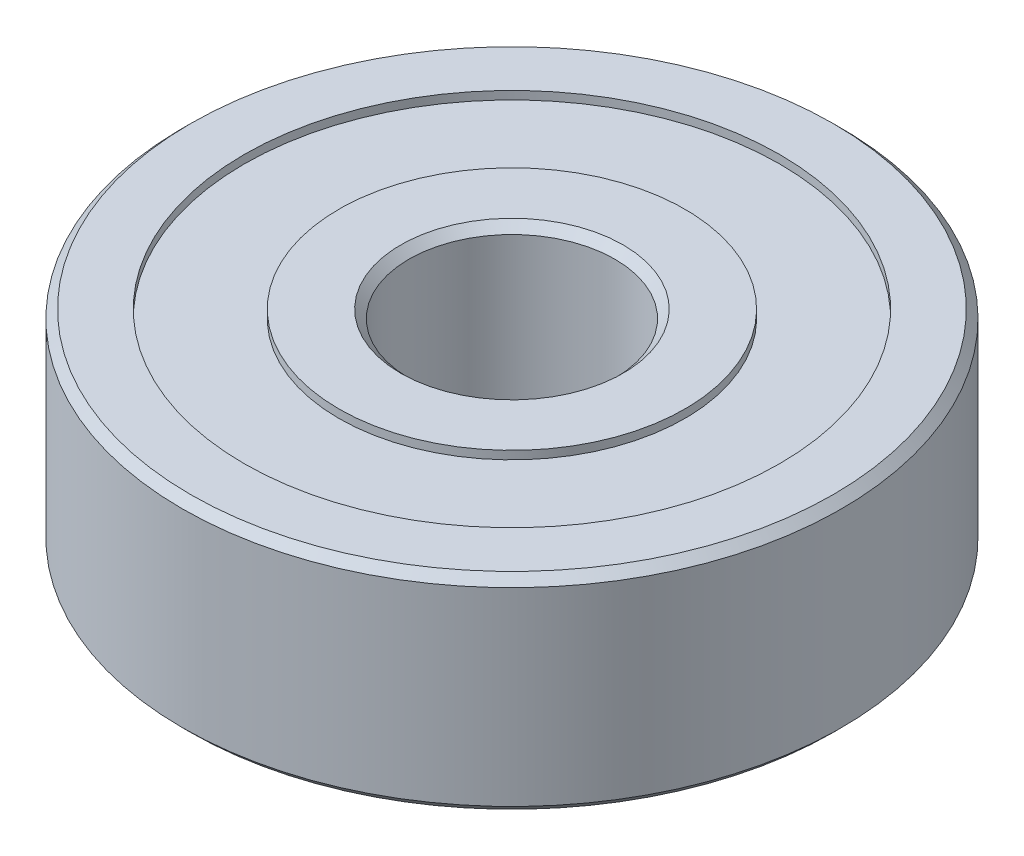
ISO-10303-21;
HEADER;
FILE_DESCRIPTION(('STEP AP214'),'2;1');
FILE_NAME('part.step','',(''),(''),'','','');
FILE_SCHEMA(('AUTOMOTIVE_DESIGN { 1 0 10303 214 1 1 1 1 }'));
ENDSEC;
DATA;
#1=APPLICATION_CONTEXT('core data for automotive mechanical design processes');
#2=APPLICATION_PROTOCOL_DEFINITION('international standard','automotive_design',2000,#1);
#3=PRODUCT_CONTEXT('',#1,'mechanical');
#4=PRODUCT('Part','Part','',(#3));
#5=PRODUCT_RELATED_PRODUCT_CATEGORY('part','',(#4));
#6=PRODUCT_DEFINITION_FORMATION('','',#4);
#7=PRODUCT_DEFINITION_CONTEXT('part definition',#1,'design');
#8=PRODUCT_DEFINITION('design','',#6,#7);
#9=PRODUCT_DEFINITION_SHAPE('','',#8);
#10=(LENGTH_UNIT() NAMED_UNIT(*) SI_UNIT(.MILLI.,.METRE.));
#11=(NAMED_UNIT(*) PLANE_ANGLE_UNIT() SI_UNIT($,.RADIAN.));
#12=(NAMED_UNIT(*) SI_UNIT($,.STERADIAN.) SOLID_ANGLE_UNIT());
#13=UNCERTAINTY_MEASURE_WITH_UNIT(LENGTH_MEASURE(1.E-05),#10,'distance_accuracy_value','');
#14=(GEOMETRIC_REPRESENTATION_CONTEXT(3) GLOBAL_UNCERTAINTY_ASSIGNED_CONTEXT((#13)) GLOBAL_UNIT_ASSIGNED_CONTEXT((#10,
#11,#12)) REPRESENTATION_CONTEXT('',''));
#15=CARTESIAN_POINT('',(0.,0.,0.));
#16=DIRECTION('',(0.,0.,1.));
#17=DIRECTION('',(1.,0.,0.));
#18=AXIS2_PLACEMENT_3D('',#15,#16,#17);
#19=CARTESIAN_POINT('',(0.,0.,0.));
#20=DIRECTION('',(0.,1.,0.));
#21=DIRECTION('',(0.,0.,1.));
#22=AXIS2_PLACEMENT_3D('',#19,#20,#21);
#23=PLANE('',#22);
#24=CARTESIAN_POINT('',(0.,0.,0.));
#25=DIRECTION('',(0.,1.,0.));
#26=DIRECTION('',(0.,0.,1.));
#27=AXIS2_PLACEMENT_3D('',#24,#25,#26);
#28=CIRCLE('',#27,2.69999999999999);
#29=CARTESIAN_POINT('',(0.,0.,2.69999999999999));
#30=VERTEX_POINT('',#29);
#31=EDGE_CURVE('E10',#30,#30,#28,.T.);
#32=ORIENTED_EDGE('',*,*,#31,.T.);
#33=EDGE_LOOP('',(#32));
#34=FACE_BOUND('',#33,.T.);
#35=CARTESIAN_POINT('',(0.,0.,0.));
#36=DIRECTION('',(0.,-1.,0.));
#37=DIRECTION('',(0.,0.,-1.));
#38=AXIS2_PLACEMENT_3D('',#35,#36,#37);
#39=CIRCLE('',#38,4.2);
#40=CARTESIAN_POINT('',(0.,0.,-4.2));
#41=VERTEX_POINT('',#40);
#42=EDGE_CURVE('E86',#41,#41,#39,.T.);
#43=ORIENTED_EDGE('',*,*,#42,.T.);
#44=EDGE_LOOP('',(#43));
#45=FACE_BOUND('',#44,.T.);
#46=ADVANCED_FACE('F34',(#34,#45),#23,.F.);
#47=CARTESIAN_POINT('',(0.,5.,0.));
#48=DIRECTION('',(0.,1.,0.));
#49=DIRECTION('',(0.,0.,1.));
#50=AXIS2_PLACEMENT_3D('',#47,#48,#49);
#51=PLANE('',#50);
#52=CARTESIAN_POINT('',(0.,5.,0.));
#53=DIRECTION('',(0.,1.,0.));
#54=DIRECTION('',(0.,0.,1.));
#55=AXIS2_PLACEMENT_3D('',#52,#53,#54);
#56=CIRCLE('',#55,2.7);
#57=CARTESIAN_POINT('',(0.,5.,2.7));
#58=VERTEX_POINT('',#57);
#59=EDGE_CURVE('E42',#58,#58,#56,.F.);
#60=ORIENTED_EDGE('',*,*,#59,.T.);
#61=EDGE_LOOP('',(#60));
#62=FACE_BOUND('',#61,.T.);
#63=CARTESIAN_POINT('',(0.,5.,0.));
#64=DIRECTION('',(0.,1.,0.));
#65=DIRECTION('',(0.,0.,1.));
#66=AXIS2_PLACEMENT_3D('',#63,#64,#65);
#67=CIRCLE('',#66,4.2);
#68=CARTESIAN_POINT('',(0.,5.,4.2));
#69=VERTEX_POINT('',#68);
#70=EDGE_CURVE('E74',#69,#69,#67,.T.);
#71=ORIENTED_EDGE('',*,*,#70,.T.);
#72=EDGE_LOOP('',(#71));
#73=FACE_BOUND('',#72,.T.);
#74=ADVANCED_FACE('F121',(#62,#73),#51,.T.);
#75=CARTESIAN_POINT('',(0.,5.,0.));
#76=DIRECTION('',(0.,1.,0.));
#77=DIRECTION('',(0.,0.,1.));
#78=AXIS2_PLACEMENT_3D('',#75,#76,#77);
#79=CIRCLE('',#78,7.80000000000001);
#80=CARTESIAN_POINT('',(0.,5.,7.80000000000001));
#81=VERTEX_POINT('',#80);
#82=EDGE_CURVE('E64',#81,#81,#79,.T.);
#83=ORIENTED_EDGE('',*,*,#82,.T.);
#84=EDGE_LOOP('',(#83));
#85=FACE_BOUND('',#84,.T.);
#86=CARTESIAN_POINT('',(0.,5.,0.));
#87=DIRECTION('',(0.,1.,0.));
#88=DIRECTION('',(0.,0.,1.));
#89=AXIS2_PLACEMENT_3D('',#86,#87,#88);
#90=CIRCLE('',#89,6.5);
#91=CARTESIAN_POINT('',(0.,5.,6.5));
#92=VERTEX_POINT('',#91);
#93=EDGE_CURVE('E68',#92,#92,#90,.T.);
#94=ORIENTED_EDGE('',*,*,#93,.F.);
#95=EDGE_LOOP('',(#94));
#96=FACE_BOUND('',#95,.T.);
#97=ADVANCED_FACE('F111',(#85,#96),#51,.T.);
#98=CARTESIAN_POINT('',(0.,0.,0.));
#99=DIRECTION('',(0.,1.,0.));
#100=DIRECTION('',(0.,0.,1.));
#101=AXIS2_PLACEMENT_3D('',#98,#99,#100);
#102=CIRCLE('',#101,7.8);
#103=CARTESIAN_POINT('',(0.,0.,7.8));
#104=VERTEX_POINT('',#103);
#105=EDGE_CURVE('E55',#104,#104,#102,.F.);
#106=ORIENTED_EDGE('',*,*,#105,.T.);
#107=EDGE_LOOP('',(#106));
#108=FACE_BOUND('',#107,.T.);
#109=CARTESIAN_POINT('',(0.,0.,0.));
#110=DIRECTION('',(0.,-1.,0.));
#111=DIRECTION('',(0.,0.,-1.));
#112=AXIS2_PLACEMENT_3D('',#109,#110,#111);
#113=CIRCLE('',#112,6.5);
#114=CARTESIAN_POINT('',(0.,0.,-6.5));
#115=VERTEX_POINT('',#114);
#116=EDGE_CURVE('E80',#115,#115,#113,.T.);
#117=ORIENTED_EDGE('',*,*,#116,.F.);
#118=EDGE_LOOP('',(#117));
#119=FACE_BOUND('',#118,.T.);
#120=ADVANCED_FACE('F108',(#108,#119),#23,.F.);
#121=CARTESIAN_POINT('',(0.,5.,0.));
#122=DIRECTION('',(0.,-1.,0.));
#123=DIRECTION('',(0.,0.,-1.));
#124=AXIS2_PLACEMENT_3D('',#121,#122,#123);
#125=CYLINDRICAL_SURFACE('',#124,8.);
#126=CARTESIAN_POINT('',(0.,4.80000000000001,0.));
#127=DIRECTION('',(0.,1.,0.));
#128=DIRECTION('',(0.,0.,1.));
#129=AXIS2_PLACEMENT_3D('',#126,#127,#128);
#130=CIRCLE('',#129,8.);
#131=CARTESIAN_POINT('',(0.,4.80000000000001,8.));
#132=VERTEX_POINT('',#131);
#133=EDGE_CURVE('E58',#132,#132,#130,.F.);
#134=ORIENTED_EDGE('',*,*,#133,.T.);
#135=EDGE_LOOP('',(#134));
#136=FACE_BOUND('',#135,.T.);
#137=CARTESIAN_POINT('',(0.,0.199999999999999,0.));
#138=DIRECTION('',(0.,1.,0.));
#139=DIRECTION('',(0.,0.,1.));
#140=AXIS2_PLACEMENT_3D('',#137,#138,#139);
#141=CIRCLE('',#140,8.);
#142=CARTESIAN_POINT('',(0.,0.199999999999999,8.));
#143=VERTEX_POINT('',#142);
#144=EDGE_CURVE('E61',#143,#143,#141,.T.);
#145=ORIENTED_EDGE('',*,*,#144,.T.);
#146=EDGE_LOOP('',(#145));
#147=FACE_BOUND('',#146,.T.);
#148=ADVANCED_FACE('F110',(#136,#147),#125,.T.);
#149=CARTESIAN_POINT('',(0.,5.,0.));
#150=DIRECTION('',(0.,-1.,0.));
#151=DIRECTION('',(0.,0.,-1.));
#152=AXIS2_PLACEMENT_3D('',#149,#150,#151);
#153=CYLINDRICAL_SURFACE('',#152,2.5);
#154=CARTESIAN_POINT('',(0.,4.80000000000001,0.));
#155=DIRECTION('',(0.,1.,0.));
#156=DIRECTION('',(0.,0.,1.));
#157=AXIS2_PLACEMENT_3D('',#154,#155,#156);
#158=CIRCLE('',#157,2.5);
#159=CARTESIAN_POINT('',(0.,4.80000000000001,2.5));
#160=VERTEX_POINT('',#159);
#161=EDGE_CURVE('E46',#160,#160,#158,.T.);
#162=ORIENTED_EDGE('',*,*,#161,.T.);
#163=EDGE_LOOP('',(#162));
#164=FACE_BOUND('',#163,.T.);
#165=CARTESIAN_POINT('',(0.,0.199999999999996,0.));
#166=DIRECTION('',(0.,1.,0.));
#167=DIRECTION('',(0.,0.,1.));
#168=AXIS2_PLACEMENT_3D('',#165,#166,#167);
#169=CIRCLE('',#168,2.5);
#170=CARTESIAN_POINT('',(0.,0.199999999999996,2.5));
#171=VERTEX_POINT('',#170);
#172=EDGE_CURVE('E50',#171,#171,#169,.F.);
#173=ORIENTED_EDGE('',*,*,#172,.T.);
#174=EDGE_LOOP('',(#173));
#175=FACE_BOUND('',#174,.T.);
#176=ADVANCED_FACE('F118',(#164,#175),#153,.F.);
#177=CARTESIAN_POINT('',(0.,4.8,0.));
#178=DIRECTION('',(0.,1.,0.));
#179=DIRECTION('',(0.,0.,1.));
#180=AXIS2_PLACEMENT_3D('',#177,#178,#179);
#181=CYLINDRICAL_SURFACE('',#180,6.5);
#182=CARTESIAN_POINT('',(0.,4.8,0.));
#183=DIRECTION('',(0.,1.,0.));
#184=DIRECTION('',(0.,0.,1.));
#185=AXIS2_PLACEMENT_3D('',#182,#183,#184);
#186=CIRCLE('',#185,6.5);
#187=CARTESIAN_POINT('',(0.,4.8,6.5));
#188=VERTEX_POINT('',#187);
#189=EDGE_CURVE('E67',#188,#188,#186,.T.);
#190=ORIENTED_EDGE('',*,*,#189,.F.);
#191=EDGE_LOOP('',(#190));
#192=FACE_BOUND('',#191,.T.);
#193=ORIENTED_EDGE('',*,*,#93,.T.);
#194=EDGE_LOOP('',(#193));
#195=FACE_BOUND('',#194,.T.);
#196=ADVANCED_FACE('F146',(#192,#195),#181,.F.);
#197=CARTESIAN_POINT('',(0.,4.8,0.));
#198=DIRECTION('',(0.,1.,0.));
#199=DIRECTION('',(0.,0.,1.));
#200=AXIS2_PLACEMENT_3D('',#197,#198,#199);
#201=PLANE('',#200);
#202=CARTESIAN_POINT('',(0.,4.8,0.));
#203=DIRECTION('',(0.,1.,0.));
#204=DIRECTION('',(0.,0.,1.));
#205=AXIS2_PLACEMENT_3D('',#202,#203,#204);
#206=CIRCLE('',#205,4.2);
#207=CARTESIAN_POINT('',(0.,4.8,4.2));
#208=VERTEX_POINT('',#207);
#209=EDGE_CURVE('E71',#208,#208,#206,.T.);
#210=ORIENTED_EDGE('',*,*,#209,.F.);
#211=EDGE_LOOP('',(#210));
#212=FACE_BOUND('',#211,.T.);
#213=ORIENTED_EDGE('',*,*,#189,.T.);
#214=EDGE_LOOP('',(#213));
#215=FACE_BOUND('',#214,.T.);
#216=ADVANCED_FACE('F142',(#212,#215),#201,.T.);
#217=CARTESIAN_POINT('',(0.,4.8,0.));
#218=DIRECTION('',(0.,1.,0.));
#219=DIRECTION('',(0.,0.,1.));
#220=AXIS2_PLACEMENT_3D('',#217,#218,#219);
#221=CYLINDRICAL_SURFACE('',#220,4.2);
#222=ORIENTED_EDGE('',*,*,#209,.T.);
#223=EDGE_LOOP('',(#222));
#224=FACE_BOUND('',#223,.T.);
#225=ORIENTED_EDGE('',*,*,#70,.F.);
#226=EDGE_LOOP('',(#225));
#227=FACE_BOUND('',#226,.T.);
#228=ADVANCED_FACE('F104',(#224,#227),#221,.T.);
#229=CARTESIAN_POINT('',(0.,0.2,0.));
#230=DIRECTION('',(0.,-1.,0.));
#231=DIRECTION('',(0.,0.,-1.));
#232=AXIS2_PLACEMENT_3D('',#229,#230,#231);
#233=CYLINDRICAL_SURFACE('',#232,6.5);
#234=CARTESIAN_POINT('',(0.,0.2,0.));
#235=DIRECTION('',(0.,-1.,0.));
#236=DIRECTION('',(0.,0.,-1.));
#237=AXIS2_PLACEMENT_3D('',#234,#235,#236);
#238=CIRCLE('',#237,6.5);
#239=CARTESIAN_POINT('',(0.,0.2,-6.5));
#240=VERTEX_POINT('',#239);
#241=EDGE_CURVE('E77',#240,#240,#238,.T.);
#242=ORIENTED_EDGE('',*,*,#241,.F.);
#243=EDGE_LOOP('',(#242));
#244=FACE_BOUND('',#243,.T.);
#245=ORIENTED_EDGE('',*,*,#116,.T.);
#246=EDGE_LOOP('',(#245));
#247=FACE_BOUND('',#246,.T.);
#248=ADVANCED_FACE('F98',(#244,#247),#233,.F.);
#249=CARTESIAN_POINT('',(0.,0.2,0.));
#250=DIRECTION('',(0.,-1.,0.));
#251=DIRECTION('',(0.,0.,-1.));
#252=AXIS2_PLACEMENT_3D('',#249,#250,#251);
#253=PLANE('',#252);
#254=CARTESIAN_POINT('',(0.,0.2,0.));
#255=DIRECTION('',(0.,-1.,0.));
#256=DIRECTION('',(0.,0.,-1.));
#257=AXIS2_PLACEMENT_3D('',#254,#255,#256);
#258=CIRCLE('',#257,4.2);
#259=CARTESIAN_POINT('',(0.,0.2,-4.2));
#260=VERTEX_POINT('',#259);
#261=EDGE_CURVE('E83',#260,#260,#258,.T.);
#262=ORIENTED_EDGE('',*,*,#261,.F.);
#263=EDGE_LOOP('',(#262));
#264=FACE_BOUND('',#263,.T.);
#265=ORIENTED_EDGE('',*,*,#241,.T.);
#266=EDGE_LOOP('',(#265));
#267=FACE_BOUND('',#266,.T.);
#268=ADVANCED_FACE('F95',(#264,#267),#253,.T.);
#269=CARTESIAN_POINT('',(0.,0.2,0.));
#270=DIRECTION('',(0.,-1.,0.));
#271=DIRECTION('',(0.,0.,-1.));
#272=AXIS2_PLACEMENT_3D('',#269,#270,#271);
#273=CYLINDRICAL_SURFACE('',#272,4.2);
#274=ORIENTED_EDGE('',*,*,#261,.T.);
#275=EDGE_LOOP('',(#274));
#276=FACE_BOUND('',#275,.T.);
#277=ORIENTED_EDGE('',*,*,#42,.F.);
#278=EDGE_LOOP('',(#277));
#279=FACE_BOUND('',#278,.T.);
#280=ADVANCED_FACE('F92',(#276,#279),#273,.T.);
#281=CARTESIAN_POINT('',(0.,5.,0.));
#282=DIRECTION('',(0.,-1.,0.));
#283=DIRECTION('',(0.,0.,-1.));
#284=AXIS2_PLACEMENT_3D('',#281,#282,#283);
#285=CONICAL_SURFACE('',#284,7.80000000000001,0.785398163397448);
#286=ORIENTED_EDGE('',*,*,#133,.F.);
#287=EDGE_LOOP('',(#286));
#288=FACE_BOUND('',#287,.T.);
#289=ORIENTED_EDGE('',*,*,#82,.F.);
#290=EDGE_LOOP('',(#289));
#291=FACE_BOUND('',#290,.T.);
#292=ADVANCED_FACE('F131',(#288,#291),#285,.T.);
#293=CARTESIAN_POINT('',(0.,0.199999999999999,0.));
#294=DIRECTION('',(0.,1.,0.));
#295=DIRECTION('',(0.,0.,1.));
#296=AXIS2_PLACEMENT_3D('',#293,#294,#295);
#297=CONICAL_SURFACE('',#296,8.,0.785398163397444);
#298=ORIENTED_EDGE('',*,*,#105,.F.);
#299=EDGE_LOOP('',(#298));
#300=FACE_BOUND('',#299,.T.);
#301=ORIENTED_EDGE('',*,*,#144,.F.);
#302=EDGE_LOOP('',(#301));
#303=FACE_BOUND('',#302,.T.);
#304=ADVANCED_FACE('F136',(#300,#303),#297,.T.);
#305=CARTESIAN_POINT('',(0.,4.80000000000001,0.));
#306=DIRECTION('',(0.,1.,0.));
#307=DIRECTION('',(0.,0.,1.));
#308=AXIS2_PLACEMENT_3D('',#305,#306,#307);
#309=CONICAL_SURFACE('',#308,2.5,0.785398163397458);
#310=ORIENTED_EDGE('',*,*,#59,.F.);
#311=EDGE_LOOP('',(#310));
#312=FACE_BOUND('',#311,.T.);
#313=ORIENTED_EDGE('',*,*,#161,.F.);
#314=EDGE_LOOP('',(#313));
#315=FACE_BOUND('',#314,.T.);
#316=ADVANCED_FACE('F161',(#312,#315),#309,.F.);
#317=CARTESIAN_POINT('',(0.,0.,0.));
#318=DIRECTION('',(0.,-1.,0.));
#319=DIRECTION('',(0.,0.,-1.));
#320=AXIS2_PLACEMENT_3D('',#317,#318,#319);
#321=CONICAL_SURFACE('',#320,2.69999999999999,0.785398163397439);
#322=ORIENTED_EDGE('',*,*,#172,.F.);
#323=EDGE_LOOP('',(#322));
#324=FACE_BOUND('',#323,.T.);
#325=ORIENTED_EDGE('',*,*,#31,.F.);
#326=EDGE_LOOP('',(#325));
#327=FACE_BOUND('',#326,.T.);
#328=ADVANCED_FACE('F37',(#324,#327),#321,.F.);
#329=CLOSED_SHELL('',(#46,#74,#97,#120,#148,#176,#196,#216,#228,#248,#268,#280,#292,#304,#316,#328));
#330=MANIFOLD_SOLID_BREP('B2',#329);
#331=ADVANCED_BREP_SHAPE_REPRESENTATION('',(#18,#330),#14);
#332=SHAPE_DEFINITION_REPRESENTATION(#9,#331);
ENDSEC;
END-ISO-10303-21;
